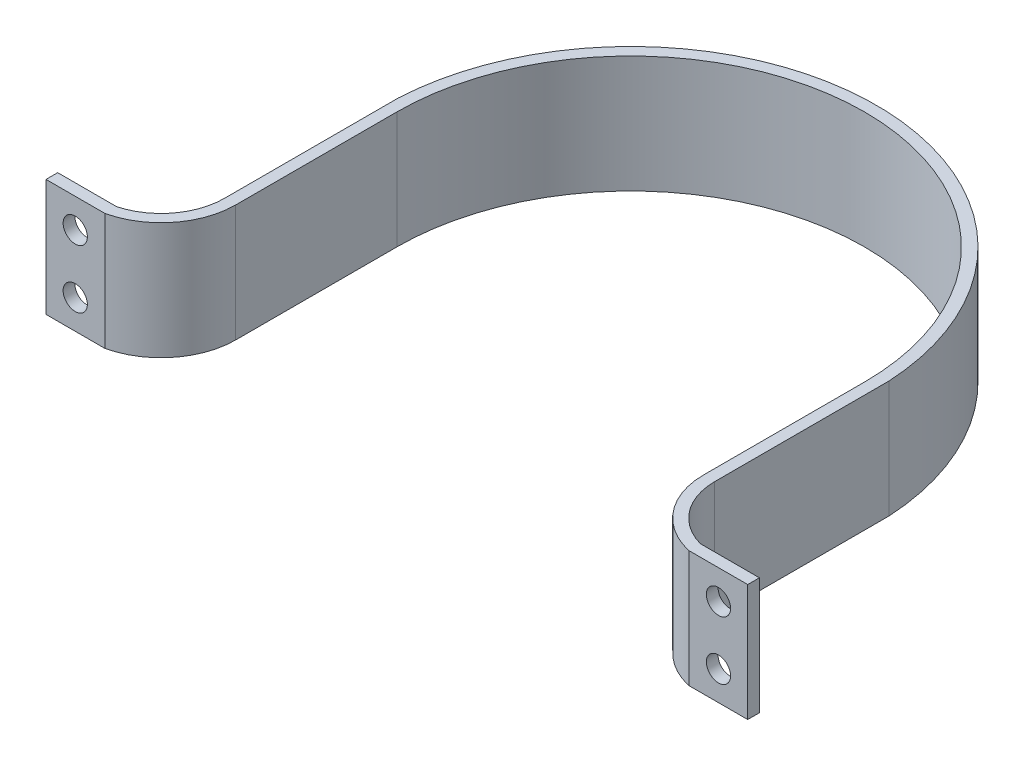
ISO-10303-21;
HEADER;
FILE_DESCRIPTION(('STEP AP214'),'2;1');
FILE_NAME('part.step','',(''),(''),'','','');
FILE_SCHEMA(('AUTOMOTIVE_DESIGN { 1 0 10303 214 1 1 1 1 }'));
ENDSEC;
DATA;
#1=APPLICATION_CONTEXT('core data for automotive mechanical design processes');
#2=APPLICATION_PROTOCOL_DEFINITION('international standard','automotive_design',2000,#1);
#3=PRODUCT_CONTEXT('',#1,'mechanical');
#4=PRODUCT('Part','Part','',(#3));
#5=PRODUCT_RELATED_PRODUCT_CATEGORY('part','',(#4));
#6=PRODUCT_DEFINITION_FORMATION('','',#4);
#7=PRODUCT_DEFINITION_CONTEXT('part definition',#1,'design');
#8=PRODUCT_DEFINITION('design','',#6,#7);
#9=PRODUCT_DEFINITION_SHAPE('','',#8);
#10=(LENGTH_UNIT() NAMED_UNIT(*) SI_UNIT(.MILLI.,.METRE.));
#11=(NAMED_UNIT(*) PLANE_ANGLE_UNIT() SI_UNIT($,.RADIAN.));
#12=(NAMED_UNIT(*) SI_UNIT($,.STERADIAN.) SOLID_ANGLE_UNIT());
#13=UNCERTAINTY_MEASURE_WITH_UNIT(LENGTH_MEASURE(1.E-05),#10,'distance_accuracy_value','');
#14=(GEOMETRIC_REPRESENTATION_CONTEXT(3) GLOBAL_UNCERTAINTY_ASSIGNED_CONTEXT((#13)) GLOBAL_UNIT_ASSIGNED_CONTEXT((#10,
#11,#12)) REPRESENTATION_CONTEXT('',''));
#15=CARTESIAN_POINT('',(0.,0.,0.));
#16=DIRECTION('',(0.,0.,1.));
#17=DIRECTION('',(1.,0.,0.));
#18=AXIS2_PLACEMENT_3D('',#15,#16,#17);
#19=CARTESIAN_POINT('',(24.9634711057996,10.,20.));
#20=DIRECTION('',(0.,0.,-1.));
#21=DIRECTION('',(-1.,0.,0.));
#22=AXIS2_PLACEMENT_3D('',#19,#20,#21);
#23=PLANE('',#22);
#24=DIRECTION('',(1.,0.,0.));
#25=VECTOR('',#24,1.);
#26=CARTESIAN_POINT('',(24.9634711057996,0.,20.));
#27=LINE('',#26,#25);
#28=CARTESIAN_POINT('',(24.9634711057996,0.,20.));
#29=VERTEX_POINT('',#28);
#30=CARTESIAN_POINT('',(30.0034711057996,0.,20.));
#31=VERTEX_POINT('',#30);
#32=EDGE_CURVE('E203',#29,#31,#27,.T.);
#33=ORIENTED_EDGE('',*,*,#32,.T.);
#34=DIRECTION('',(0.,-1.,0.));
#35=VECTOR('',#34,1.);
#36=CARTESIAN_POINT('',(30.0034711057996,10.,20.));
#37=LINE('',#36,#35);
#38=CARTESIAN_POINT('',(30.0034711057996,10.,20.));
#39=VERTEX_POINT('',#38);
#40=EDGE_CURVE('E229',#39,#31,#37,.T.);
#41=ORIENTED_EDGE('',*,*,#40,.F.);
#42=DIRECTION('',(1.,0.,0.));
#43=VECTOR('',#42,1.);
#44=CARTESIAN_POINT('',(24.9634711057996,10.,20.));
#45=LINE('',#44,#43);
#46=CARTESIAN_POINT('',(24.9634711057996,10.,20.));
#47=VERTEX_POINT('',#46);
#48=EDGE_CURVE('E289',#47,#39,#45,.T.);
#49=ORIENTED_EDGE('',*,*,#48,.F.);
#50=DIRECTION('',(0.,-1.,0.));
#51=VECTOR('',#50,1.);
#52=CARTESIAN_POINT('',(24.9634711057996,10.,20.));
#53=LINE('',#52,#51);
#54=EDGE_CURVE('E226',#47,#29,#53,.T.);
#55=ORIENTED_EDGE('',*,*,#54,.T.);
#56=EDGE_LOOP('',(#33,#41,#49,#55));
#57=FACE_BOUND('',#56,.T.);
#58=CARTESIAN_POINT('',(27.5034711057996,7.5,20.));
#59=DIRECTION('',(0.,0.,-1.));
#60=DIRECTION('',(-1.,0.,0.));
#61=AXIS2_PLACEMENT_3D('',#58,#59,#60);
#62=CIRCLE('',#61,1.03605010560066);
#63=CARTESIAN_POINT('',(26.4674210001989,7.5,20.));
#64=VERTEX_POINT('',#63);
#65=EDGE_CURVE('E268',#64,#64,#62,.T.);
#66=ORIENTED_EDGE('',*,*,#65,.T.);
#67=EDGE_LOOP('',(#66));
#68=FACE_BOUND('',#67,.T.);
#69=CARTESIAN_POINT('',(27.5034711057996,2.5,20.));
#70=DIRECTION('',(0.,0.,1.));
#71=DIRECTION('',(1.,0.,0.));
#72=AXIS2_PLACEMENT_3D('',#69,#70,#71);
#73=CIRCLE('',#72,1.03605010560066);
#74=CARTESIAN_POINT('',(28.5395212114003,2.5,20.));
#75=VERTEX_POINT('',#74);
#76=EDGE_CURVE('E409',#75,#75,#73,.T.);
#77=ORIENTED_EDGE('',*,*,#76,.F.);
#78=EDGE_LOOP('',(#77));
#79=FACE_BOUND('',#78,.T.);
#80=ADVANCED_FACE('F33',(#57,#68,#79),#23,.F.);
#81=CARTESIAN_POINT('',(24.9634711057996,10.,19.));
#82=DIRECTION('',(0.,0.,-1.));
#83=DIRECTION('',(-1.,0.,0.));
#84=AXIS2_PLACEMENT_3D('',#81,#82,#83);
#85=PLANE('',#84);
#86=CARTESIAN_POINT('',(27.5034711057996,7.5,19.));
#87=DIRECTION('',(0.,0.,-1.));
#88=DIRECTION('',(-1.,0.,0.));
#89=AXIS2_PLACEMENT_3D('',#86,#87,#88);
#90=CIRCLE('',#89,1.03605010560066);
#91=CARTESIAN_POINT('',(26.4674210001989,7.5,19.));
#92=VERTEX_POINT('',#91);
#93=EDGE_CURVE('E254',#92,#92,#90,.F.);
#94=ORIENTED_EDGE('',*,*,#93,.T.);
#95=EDGE_LOOP('',(#94));
#96=FACE_BOUND('',#95,.T.);
#97=DIRECTION('',(1.,0.,0.));
#98=VECTOR('',#97,1.);
#99=CARTESIAN_POINT('',(24.9634711057996,0.,19.));
#100=LINE('',#99,#98);
#101=CARTESIAN_POINT('',(24.9634711057996,0.,19.));
#102=VERTEX_POINT('',#101);
#103=CARTESIAN_POINT('',(30.0034711057996,0.,19.));
#104=VERTEX_POINT('',#103);
#105=EDGE_CURVE('E197',#102,#104,#100,.T.);
#106=ORIENTED_EDGE('',*,*,#105,.F.);
#107=DIRECTION('',(0.,-1.,0.));
#108=VECTOR('',#107,1.);
#109=CARTESIAN_POINT('',(24.9634711057996,10.,19.));
#110=LINE('',#109,#108);
#111=CARTESIAN_POINT('',(24.9634711057996,10.,19.));
#112=VERTEX_POINT('',#111);
#113=EDGE_CURVE('E234',#112,#102,#110,.T.);
#114=ORIENTED_EDGE('',*,*,#113,.F.);
#115=DIRECTION('',(1.,0.,0.));
#116=VECTOR('',#115,1.);
#117=CARTESIAN_POINT('',(24.9634711057996,10.,19.));
#118=LINE('',#117,#116);
#119=CARTESIAN_POINT('',(30.0034711057996,10.,19.));
#120=VERTEX_POINT('',#119);
#121=EDGE_CURVE('E284',#112,#120,#118,.T.);
#122=ORIENTED_EDGE('',*,*,#121,.T.);
#123=DIRECTION('',(0.,-1.,0.));
#124=VECTOR('',#123,1.);
#125=CARTESIAN_POINT('',(30.0034711057996,10.,19.));
#126=LINE('',#125,#124);
#127=EDGE_CURVE('E232',#120,#104,#126,.T.);
#128=ORIENTED_EDGE('',*,*,#127,.T.);
#129=EDGE_LOOP('',(#106,#114,#122,#128));
#130=FACE_BOUND('',#129,.T.);
#131=CARTESIAN_POINT('',(27.5034711057996,2.5,19.));
#132=DIRECTION('',(0.,0.,-1.));
#133=DIRECTION('',(-1.,0.,0.));
#134=AXIS2_PLACEMENT_3D('',#131,#132,#133);
#135=CIRCLE('',#134,1.03605010560066);
#136=CARTESIAN_POINT('',(26.4674210001989,2.5,19.));
#137=VERTEX_POINT('',#136);
#138=EDGE_CURVE('E37',#137,#137,#135,.T.);
#139=ORIENTED_EDGE('',*,*,#138,.F.);
#140=EDGE_LOOP('',(#139));
#141=FACE_BOUND('',#140,.T.);
#142=ADVANCED_FACE('F320',(#96,#130,#141),#85,.T.);
#143=CARTESIAN_POINT('',(-30.0034711057996,10.,20.));
#144=DIRECTION('',(-1.,0.,0.));
#145=DIRECTION('',(0.,0.,1.));
#146=AXIS2_PLACEMENT_3D('',#143,#144,#145);
#147=PLANE('',#146);
#148=DIRECTION('',(0.,0.,-1.));
#149=VECTOR('',#148,1.);
#150=CARTESIAN_POINT('',(-30.0034711057996,0.,20.));
#151=LINE('',#150,#149);
#152=CARTESIAN_POINT('',(-30.0034711057996,0.,20.));
#153=VERTEX_POINT('',#152);
#154=CARTESIAN_POINT('',(-30.0034711057996,0.,19.));
#155=VERTEX_POINT('',#154);
#156=EDGE_CURVE('E177',#153,#155,#151,.T.);
#157=ORIENTED_EDGE('',*,*,#156,.F.);
#158=DIRECTION('',(0.,-1.,0.));
#159=VECTOR('',#158,1.);
#160=CARTESIAN_POINT('',(-30.0034711057996,10.,20.));
#161=LINE('',#160,#159);
#162=CARTESIAN_POINT('',(-30.0034711057996,10.,20.));
#163=VERTEX_POINT('',#162);
#164=EDGE_CURVE('E11',#163,#153,#161,.T.);
#165=ORIENTED_EDGE('',*,*,#164,.F.);
#166=DIRECTION('',(0.,0.,-1.));
#167=VECTOR('',#166,1.);
#168=CARTESIAN_POINT('',(-30.0034711057996,10.,20.));
#169=LINE('',#168,#167);
#170=CARTESIAN_POINT('',(-30.0034711057996,10.,19.));
#171=VERTEX_POINT('',#170);
#172=EDGE_CURVE('E218',#163,#171,#169,.T.);
#173=ORIENTED_EDGE('',*,*,#172,.T.);
#174=DIRECTION('',(0.,-1.,0.));
#175=VECTOR('',#174,1.);
#176=CARTESIAN_POINT('',(-30.0034711057996,10.,19.));
#177=LINE('',#176,#175);
#178=EDGE_CURVE('E173',#171,#155,#177,.T.);
#179=ORIENTED_EDGE('',*,*,#178,.T.);
#180=EDGE_LOOP('',(#157,#165,#173,#179));
#181=FACE_BOUND('',#180,.T.);
#182=ADVANCED_FACE('F35',(#181),#147,.T.);
#183=CARTESIAN_POINT('',(-24.9634711057996,10.,20.));
#184=DIRECTION('',(0.,0.,1.));
#185=DIRECTION('',(1.,0.,0.));
#186=AXIS2_PLACEMENT_3D('',#183,#184,#185);
#187=PLANE('',#186);
#188=CARTESIAN_POINT('',(-27.5034711057996,2.5,20.));
#189=DIRECTION('',(0.,0.,-1.));
#190=DIRECTION('',(-1.,0.,0.));
#191=AXIS2_PLACEMENT_3D('',#188,#189,#190);
#192=CIRCLE('',#191,1.03605010560066);
#193=CARTESIAN_POINT('',(-28.5395212114003,2.5,20.));
#194=VERTEX_POINT('',#193);
#195=EDGE_CURVE('E255',#194,#194,#192,.T.);
#196=ORIENTED_EDGE('',*,*,#195,.T.);
#197=EDGE_LOOP('',(#196));
#198=FACE_BOUND('',#197,.T.);
#199=CARTESIAN_POINT('',(-27.5034711057996,7.5,20.));
#200=DIRECTION('',(0.,0.,1.));
#201=DIRECTION('',(1.,0.,0.));
#202=AXIS2_PLACEMENT_3D('',#199,#200,#201);
#203=CIRCLE('',#202,1.03605010560066);
#204=CARTESIAN_POINT('',(-26.4674210001989,7.5,20.));
#205=VERTEX_POINT('',#204);
#206=EDGE_CURVE('E251',#205,#205,#203,.T.);
#207=ORIENTED_EDGE('',*,*,#206,.F.);
#208=EDGE_LOOP('',(#207));
#209=FACE_BOUND('',#208,.T.);
#210=DIRECTION('',(-1.,0.,0.));
#211=VECTOR('',#210,1.);
#212=CARTESIAN_POINT('',(-24.9634711057996,0.,20.));
#213=LINE('',#212,#211);
#214=CARTESIAN_POINT('',(-24.9634711057996,0.,20.));
#215=VERTEX_POINT('',#214);
#216=EDGE_CURVE('E216',#215,#153,#213,.T.);
#217=ORIENTED_EDGE('',*,*,#216,.F.);
#218=DIRECTION('',(0.,-1.,0.));
#219=VECTOR('',#218,1.);
#220=CARTESIAN_POINT('',(-24.9634711057996,10.,20.));
#221=LINE('',#220,#219);
#222=CARTESIAN_POINT('',(-24.9634711057996,10.,20.));
#223=VERTEX_POINT('',#222);
#224=EDGE_CURVE('E43',#223,#215,#221,.T.);
#225=ORIENTED_EDGE('',*,*,#224,.F.);
#226=DIRECTION('',(-1.,0.,0.));
#227=VECTOR('',#226,1.);
#228=CARTESIAN_POINT('',(-24.9634711057996,10.,20.));
#229=LINE('',#228,#227);
#230=EDGE_CURVE('E171',#223,#163,#229,.T.);
#231=ORIENTED_EDGE('',*,*,#230,.T.);
#232=ORIENTED_EDGE('',*,*,#164,.T.);
#233=EDGE_LOOP('',(#217,#225,#231,#232));
#234=FACE_BOUND('',#233,.T.);
#235=ADVANCED_FACE('F348',(#198,#209,#234),#187,.T.);
#236=CARTESIAN_POINT('',(-26.389702049754,10.,13.7714275249696));
#237=DIRECTION('',(0.,-1.,0.));
#238=DIRECTION('',(0.,0.,-1.));
#239=AXIS2_PLACEMENT_3D('',#236,#237,#238);
#240=CYLINDRICAL_SURFACE('',#239,6.38977697437083);
#241=CARTESIAN_POINT('',(-26.389702049754,0.,13.7714275249696));
#242=DIRECTION('',(0.,-1.,0.));
#243=DIRECTION('',(0.,0.,-1.));
#244=AXIS2_PLACEMENT_3D('',#241,#242,#243);
#245=CIRCLE('',#244,6.38977697437083);
#246=CARTESIAN_POINT('',(-20.,0.,13.802370982579));
#247=VERTEX_POINT('',#246);
#248=EDGE_CURVE('E157',#247,#215,#245,.T.);
#249=ORIENTED_EDGE('',*,*,#248,.F.);
#250=DIRECTION('',(0.,-1.,0.));
#251=VECTOR('',#250,1.);
#252=CARTESIAN_POINT('',(-20.,10.,13.802370982579));
#253=LINE('',#252,#251);
#254=CARTESIAN_POINT('',(-20.,10.,13.802370982579));
#255=VERTEX_POINT('',#254);
#256=EDGE_CURVE('E151',#255,#247,#253,.T.);
#257=ORIENTED_EDGE('',*,*,#256,.F.);
#258=CARTESIAN_POINT('',(-26.389702049754,10.,13.7714275249696));
#259=DIRECTION('',(0.,-1.,0.));
#260=DIRECTION('',(0.,0.,-1.));
#261=AXIS2_PLACEMENT_3D('',#258,#259,#260);
#262=CIRCLE('',#261,6.38977697437083);
#263=EDGE_CURVE('E155',#255,#223,#262,.T.);
#264=ORIENTED_EDGE('',*,*,#263,.T.);
#265=ORIENTED_EDGE('',*,*,#224,.T.);
#266=EDGE_LOOP('',(#249,#257,#264,#265));
#267=FACE_BOUND('',#266,.T.);
#268=ADVANCED_FACE('F153',(#267),#240,.T.);
#269=CARTESIAN_POINT('',(-20.,10.,13.802370982579));
#270=DIRECTION('',(-1.,0.,0.));
#271=DIRECTION('',(0.,0.,1.));
#272=AXIS2_PLACEMENT_3D('',#269,#270,#271);
#273=PLANE('',#272);
#274=DIRECTION('',(0.,0.,-1.));
#275=VECTOR('',#274,1.);
#276=CARTESIAN_POINT('',(-20.,0.,13.802370982579));
#277=LINE('',#276,#275);
#278=CARTESIAN_POINT('',(-20.,0.,0.));
#279=VERTEX_POINT('',#278);
#280=EDGE_CURVE('E213',#247,#279,#277,.T.);
#281=ORIENTED_EDGE('',*,*,#280,.T.);
#282=DIRECTION('',(0.,-1.,0.));
#283=VECTOR('',#282,1.);
#284=CARTESIAN_POINT('',(-20.,10.,0.));
#285=LINE('',#284,#283);
#286=CARTESIAN_POINT('',(-20.,10.,0.));
#287=VERTEX_POINT('',#286);
#288=EDGE_CURVE('E161',#287,#279,#285,.T.);
#289=ORIENTED_EDGE('',*,*,#288,.F.);
#290=DIRECTION('',(0.,0.,-1.));
#291=VECTOR('',#290,1.);
#292=CARTESIAN_POINT('',(-20.,10.,13.802370982579));
#293=LINE('',#292,#291);
#294=EDGE_CURVE('E164',#255,#287,#293,.T.);
#295=ORIENTED_EDGE('',*,*,#294,.F.);
#296=ORIENTED_EDGE('',*,*,#256,.T.);
#297=EDGE_LOOP('',(#281,#289,#295,#296));
#298=FACE_BOUND('',#297,.T.);
#299=ADVANCED_FACE('F165',(#298),#273,.F.);
#300=CARTESIAN_POINT('',(0.,10.,0.));
#301=DIRECTION('',(0.,-1.,0.));
#302=DIRECTION('',(0.,0.,-1.));
#303=AXIS2_PLACEMENT_3D('',#300,#301,#302);
#304=CYLINDRICAL_SURFACE('',#303,20.);
#305=CARTESIAN_POINT('',(0.,0.,0.));
#306=DIRECTION('',(0.,1.,0.));
#307=DIRECTION('',(0.,0.,1.));
#308=AXIS2_PLACEMENT_3D('',#305,#306,#307);
#309=CIRCLE('',#308,20.);
#310=CARTESIAN_POINT('',(20.,0.,0.));
#311=VERTEX_POINT('',#310);
#312=EDGE_CURVE('E210',#311,#279,#309,.T.);
#313=ORIENTED_EDGE('',*,*,#312,.F.);
#314=DIRECTION('',(0.,-1.,0.));
#315=VECTOR('',#314,1.);
#316=CARTESIAN_POINT('',(20.,10.,0.));
#317=LINE('',#316,#315);
#318=CARTESIAN_POINT('',(20.,10.,0.));
#319=VERTEX_POINT('',#318);
#320=EDGE_CURVE('E222',#319,#311,#317,.T.);
#321=ORIENTED_EDGE('',*,*,#320,.F.);
#322=CARTESIAN_POINT('',(0.,10.,0.));
#323=DIRECTION('',(0.,1.,0.));
#324=DIRECTION('',(0.,0.,1.));
#325=AXIS2_PLACEMENT_3D('',#322,#323,#324);
#326=CIRCLE('',#325,20.);
#327=EDGE_CURVE('E168',#319,#287,#326,.T.);
#328=ORIENTED_EDGE('',*,*,#327,.T.);
#329=ORIENTED_EDGE('',*,*,#288,.T.);
#330=EDGE_LOOP('',(#313,#321,#328,#329));
#331=FACE_BOUND('',#330,.T.);
#332=ADVANCED_FACE('F297',(#331),#304,.F.);
#333=CARTESIAN_POINT('',(20.,10.,13.802370982579));
#334=DIRECTION('',(-1.,0.,0.));
#335=DIRECTION('',(0.,0.,1.));
#336=AXIS2_PLACEMENT_3D('',#333,#334,#335);
#337=PLANE('',#336);
#338=DIRECTION('',(0.,0.,-1.));
#339=VECTOR('',#338,1.);
#340=CARTESIAN_POINT('',(20.,0.,13.802370982579));
#341=LINE('',#340,#339);
#342=CARTESIAN_POINT('',(20.,0.,13.802370982579));
#343=VERTEX_POINT('',#342);
#344=EDGE_CURVE('E207',#343,#311,#341,.T.);
#345=ORIENTED_EDGE('',*,*,#344,.F.);
#346=DIRECTION('',(0.,-1.,0.));
#347=VECTOR('',#346,1.);
#348=CARTESIAN_POINT('',(20.,10.,13.802370982579));
#349=LINE('',#348,#347);
#350=CARTESIAN_POINT('',(20.,10.,13.802370982579));
#351=VERTEX_POINT('',#350);
#352=EDGE_CURVE('E224',#351,#343,#349,.T.);
#353=ORIENTED_EDGE('',*,*,#352,.F.);
#354=DIRECTION('',(0.,0.,-1.));
#355=VECTOR('',#354,1.);
#356=CARTESIAN_POINT('',(20.,10.,13.802370982579));
#357=LINE('',#356,#355);
#358=EDGE_CURVE('E293',#351,#319,#357,.T.);
#359=ORIENTED_EDGE('',*,*,#358,.T.);
#360=ORIENTED_EDGE('',*,*,#320,.T.);
#361=EDGE_LOOP('',(#345,#353,#359,#360));
#362=FACE_BOUND('',#361,.T.);
#363=ADVANCED_FACE('F301',(#362),#337,.T.);
#364=CARTESIAN_POINT('',(26.389702049754,10.,13.7714275249696));
#365=DIRECTION('',(0.,-1.,0.));
#366=DIRECTION('',(0.,0.,-1.));
#367=AXIS2_PLACEMENT_3D('',#364,#365,#366);
#368=CYLINDRICAL_SURFACE('',#367,6.38977697437083);
#369=CARTESIAN_POINT('',(26.389702049754,0.,13.7714275249696));
#370=DIRECTION('',(0.,1.,0.));
#371=DIRECTION('',(0.,0.,1.));
#372=AXIS2_PLACEMENT_3D('',#369,#370,#371);
#373=CIRCLE('',#372,6.38977697437083);
#374=EDGE_CURVE('E205',#343,#29,#373,.T.);
#375=ORIENTED_EDGE('',*,*,#374,.T.);
#376=ORIENTED_EDGE('',*,*,#54,.F.);
#377=CARTESIAN_POINT('',(26.389702049754,10.,13.7714275249696));
#378=DIRECTION('',(0.,1.,0.));
#379=DIRECTION('',(0.,0.,1.));
#380=AXIS2_PLACEMENT_3D('',#377,#378,#379);
#381=CIRCLE('',#380,6.38977697437083);
#382=EDGE_CURVE('E291',#351,#47,#381,.T.);
#383=ORIENTED_EDGE('',*,*,#382,.F.);
#384=ORIENTED_EDGE('',*,*,#352,.T.);
#385=EDGE_LOOP('',(#375,#376,#383,#384));
#386=FACE_BOUND('',#385,.T.);
#387=ADVANCED_FACE('F306',(#386),#368,.T.);
#388=CARTESIAN_POINT('',(30.0034711057996,10.,20.));
#389=DIRECTION('',(-1.,0.,0.));
#390=DIRECTION('',(0.,0.,1.));
#391=AXIS2_PLACEMENT_3D('',#388,#389,#390);
#392=PLANE('',#391);
#393=DIRECTION('',(0.,0.,-1.));
#394=VECTOR('',#393,1.);
#395=CARTESIAN_POINT('',(30.0034711057996,0.,20.));
#396=LINE('',#395,#394);
#397=EDGE_CURVE('E200',#31,#104,#396,.T.);
#398=ORIENTED_EDGE('',*,*,#397,.T.);
#399=ORIENTED_EDGE('',*,*,#127,.F.);
#400=DIRECTION('',(0.,0.,-1.));
#401=VECTOR('',#400,1.);
#402=CARTESIAN_POINT('',(30.0034711057996,10.,20.));
#403=LINE('',#402,#401);
#404=EDGE_CURVE('E287',#39,#120,#403,.T.);
#405=ORIENTED_EDGE('',*,*,#404,.F.);
#406=ORIENTED_EDGE('',*,*,#40,.T.);
#407=EDGE_LOOP('',(#398,#399,#405,#406));
#408=FACE_BOUND('',#407,.T.);
#409=ADVANCED_FACE('F317',(#408),#392,.F.);
#410=CARTESIAN_POINT('',(26.389702049754,10.,13.7714275249696));
#411=DIRECTION('',(0.,-1.,0.));
#412=DIRECTION('',(0.,0.,-1.));
#413=AXIS2_PLACEMENT_3D('',#410,#411,#412);
#414=CYLINDRICAL_SURFACE('',#413,5.41960375231794);
#415=CARTESIAN_POINT('',(26.389702049754,0.,13.7714275249696));
#416=DIRECTION('',(0.,1.,0.));
#417=DIRECTION('',(0.,0.,1.));
#418=AXIS2_PLACEMENT_3D('',#415,#416,#417);
#419=CIRCLE('',#418,5.41960375231794);
#420=CARTESIAN_POINT('',(20.9701866346482,0.,13.802370982579));
#421=VERTEX_POINT('',#420);
#422=EDGE_CURVE('E194',#421,#102,#419,.T.);
#423=ORIENTED_EDGE('',*,*,#422,.F.);
#424=DIRECTION('',(0.,-1.,0.));
#425=VECTOR('',#424,1.);
#426=CARTESIAN_POINT('',(20.9701866346482,10.,13.802370982579));
#427=LINE('',#426,#425);
#428=CARTESIAN_POINT('',(20.9701866346482,10.,13.802370982579));
#429=VERTEX_POINT('',#428);
#430=EDGE_CURVE('E236',#429,#421,#427,.T.);
#431=ORIENTED_EDGE('',*,*,#430,.F.);
#432=CARTESIAN_POINT('',(26.389702049754,10.,13.7714275249696));
#433=DIRECTION('',(0.,1.,0.));
#434=DIRECTION('',(0.,0.,1.));
#435=AXIS2_PLACEMENT_3D('',#432,#433,#434);
#436=CIRCLE('',#435,5.41960375231794);
#437=EDGE_CURVE('E281',#429,#112,#436,.T.);
#438=ORIENTED_EDGE('',*,*,#437,.T.);
#439=ORIENTED_EDGE('',*,*,#113,.T.);
#440=EDGE_LOOP('',(#423,#431,#438,#439));
#441=FACE_BOUND('',#440,.T.);
#442=ADVANCED_FACE('F325',(#441),#414,.F.);
#443=CARTESIAN_POINT('',(20.9701866346482,10.,13.802370982579));
#444=DIRECTION('',(-1.,0.,0.));
#445=DIRECTION('',(0.,0.,1.));
#446=AXIS2_PLACEMENT_3D('',#443,#444,#445);
#447=PLANE('',#446);
#448=DIRECTION('',(0.,0.,-1.));
#449=VECTOR('',#448,1.);
#450=CARTESIAN_POINT('',(20.9701866346482,0.,13.802370982579));
#451=LINE('',#450,#449);
#452=CARTESIAN_POINT('',(20.9701866346482,0.,-1.11860292687935));
#453=VERTEX_POINT('',#452);
#454=EDGE_CURVE('E192',#421,#453,#451,.T.);
#455=ORIENTED_EDGE('',*,*,#454,.T.);
#456=DIRECTION('',(0.,-1.,0.));
#457=VECTOR('',#456,1.);
#458=CARTESIAN_POINT('',(20.9701866346482,10.,-1.11860292687935));
#459=LINE('',#458,#457);
#460=CARTESIAN_POINT('',(20.9701866346482,10.,-1.11860292687935));
#461=VERTEX_POINT('',#460);
#462=EDGE_CURVE('E238',#461,#453,#459,.T.);
#463=ORIENTED_EDGE('',*,*,#462,.F.);
#464=DIRECTION('',(0.,0.,-1.));
#465=VECTOR('',#464,1.);
#466=CARTESIAN_POINT('',(20.9701866346482,10.,13.802370982579));
#467=LINE('',#466,#465);
#468=EDGE_CURVE('E279',#429,#461,#467,.T.);
#469=ORIENTED_EDGE('',*,*,#468,.F.);
#470=ORIENTED_EDGE('',*,*,#430,.T.);
#471=EDGE_LOOP('',(#455,#463,#469,#470));
#472=FACE_BOUND('',#471,.T.);
#473=ADVANCED_FACE('F330',(#472),#447,.F.);
#474=CARTESIAN_POINT('',(0.,10.,0.));
#475=DIRECTION('',(0.,-1.,0.));
#476=DIRECTION('',(0.,0.,-1.));
#477=AXIS2_PLACEMENT_3D('',#474,#475,#476);
#478=CYLINDRICAL_SURFACE('',#477,21.);
#479=CARTESIAN_POINT('',(0.,0.,0.));
#480=DIRECTION('',(0.,1.,0.));
#481=DIRECTION('',(0.,0.,1.));
#482=AXIS2_PLACEMENT_3D('',#479,#480,#481);
#483=CIRCLE('',#482,21.);
#484=CARTESIAN_POINT('',(-20.9701866346482,0.,-1.11860292687936));
#485=VERTEX_POINT('',#484);
#486=EDGE_CURVE('E189',#453,#485,#483,.T.);
#487=ORIENTED_EDGE('',*,*,#486,.T.);
#488=DIRECTION('',(0.,-1.,0.));
#489=VECTOR('',#488,1.);
#490=CARTESIAN_POINT('',(-20.9701866346482,10.,-1.11860292687936));
#491=LINE('',#490,#489);
#492=CARTESIAN_POINT('',(-20.9701866346482,10.,-1.11860292687936));
#493=VERTEX_POINT('',#492);
#494=EDGE_CURVE('E241',#493,#485,#491,.T.);
#495=ORIENTED_EDGE('',*,*,#494,.F.);
#496=CARTESIAN_POINT('',(0.,10.,0.));
#497=DIRECTION('',(0.,1.,0.));
#498=DIRECTION('',(0.,0.,1.));
#499=AXIS2_PLACEMENT_3D('',#496,#497,#498);
#500=CIRCLE('',#499,21.);
#501=EDGE_CURVE('E277',#461,#493,#500,.T.);
#502=ORIENTED_EDGE('',*,*,#501,.F.);
#503=ORIENTED_EDGE('',*,*,#462,.T.);
#504=EDGE_LOOP('',(#487,#495,#502,#503));
#505=FACE_BOUND('',#504,.T.);
#506=ADVANCED_FACE('F335',(#505),#478,.T.);
#507=CARTESIAN_POINT('',(-20.9701866346482,10.,13.802370982579));
#508=DIRECTION('',(-1.,0.,0.));
#509=DIRECTION('',(0.,0.,1.));
#510=AXIS2_PLACEMENT_3D('',#507,#508,#509);
#511=PLANE('',#510);
#512=DIRECTION('',(0.,0.,-1.));
#513=VECTOR('',#512,1.);
#514=CARTESIAN_POINT('',(-20.9701866346482,0.,13.802370982579));
#515=LINE('',#514,#513);
#516=CARTESIAN_POINT('',(-20.9701866346482,0.,13.802370982579));
#517=VERTEX_POINT('',#516);
#518=EDGE_CURVE('E186',#517,#485,#515,.T.);
#519=ORIENTED_EDGE('',*,*,#518,.F.);
#520=DIRECTION('',(0.,-1.,0.));
#521=VECTOR('',#520,1.);
#522=CARTESIAN_POINT('',(-20.9701866346482,10.,13.802370982579));
#523=LINE('',#522,#521);
#524=CARTESIAN_POINT('',(-20.9701866346482,10.,13.802370982579));
#525=VERTEX_POINT('',#524);
#526=EDGE_CURVE('E243',#525,#517,#523,.T.);
#527=ORIENTED_EDGE('',*,*,#526,.F.);
#528=DIRECTION('',(0.,0.,-1.));
#529=VECTOR('',#528,1.);
#530=CARTESIAN_POINT('',(-20.9701866346482,10.,13.802370982579));
#531=LINE('',#530,#529);
#532=EDGE_CURVE('E274',#525,#493,#531,.T.);
#533=ORIENTED_EDGE('',*,*,#532,.T.);
#534=ORIENTED_EDGE('',*,*,#494,.T.);
#535=EDGE_LOOP('',(#519,#527,#533,#534));
#536=FACE_BOUND('',#535,.T.);
#537=ADVANCED_FACE('F339',(#536),#511,.T.);
#538=CARTESIAN_POINT('',(-26.389702049754,10.,13.7714275249696));
#539=DIRECTION('',(0.,-1.,0.));
#540=DIRECTION('',(0.,0.,-1.));
#541=AXIS2_PLACEMENT_3D('',#538,#539,#540);
#542=CYLINDRICAL_SURFACE('',#541,5.41960375231794);
#543=CARTESIAN_POINT('',(-26.389702049754,0.,13.7714275249696));
#544=DIRECTION('',(0.,-1.,0.));
#545=DIRECTION('',(0.,0.,-1.));
#546=AXIS2_PLACEMENT_3D('',#543,#544,#545);
#547=CIRCLE('',#546,5.41960375231794);
#548=CARTESIAN_POINT('',(-24.9634711057996,0.,19.));
#549=VERTEX_POINT('',#548);
#550=EDGE_CURVE('E184',#517,#549,#547,.T.);
#551=ORIENTED_EDGE('',*,*,#550,.T.);
#552=DIRECTION('',(0.,-1.,0.));
#553=VECTOR('',#552,1.);
#554=CARTESIAN_POINT('',(-24.9634711057996,10.,19.));
#555=LINE('',#554,#553);
#556=CARTESIAN_POINT('',(-24.9634711057996,10.,19.));
#557=VERTEX_POINT('',#556);
#558=EDGE_CURVE('E245',#557,#549,#555,.T.);
#559=ORIENTED_EDGE('',*,*,#558,.F.);
#560=CARTESIAN_POINT('',(-26.389702049754,10.,13.7714275249696));
#561=DIRECTION('',(0.,-1.,0.));
#562=DIRECTION('',(0.,0.,-1.));
#563=AXIS2_PLACEMENT_3D('',#560,#561,#562);
#564=CIRCLE('',#563,5.41960375231794);
#565=EDGE_CURVE('E272',#525,#557,#564,.T.);
#566=ORIENTED_EDGE('',*,*,#565,.F.);
#567=ORIENTED_EDGE('',*,*,#526,.T.);
#568=EDGE_LOOP('',(#551,#559,#566,#567));
#569=FACE_BOUND('',#568,.T.);
#570=ADVANCED_FACE('F344',(#569),#542,.F.);
#571=CARTESIAN_POINT('',(-24.9634711057996,10.,19.));
#572=DIRECTION('',(0.,0.,1.));
#573=DIRECTION('',(1.,0.,0.));
#574=AXIS2_PLACEMENT_3D('',#571,#572,#573);
#575=PLANE('',#574);
#576=CARTESIAN_POINT('',(-27.5034711057996,2.5,19.));
#577=DIRECTION('',(0.,0.,1.));
#578=DIRECTION('',(1.,0.,0.));
#579=AXIS2_PLACEMENT_3D('',#576,#577,#578);
#580=CIRCLE('',#579,1.03605010560066);
#581=CARTESIAN_POINT('',(-26.4674210001989,2.5,19.));
#582=VERTEX_POINT('',#581);
#583=EDGE_CURVE('E252',#582,#582,#580,.F.);
#584=ORIENTED_EDGE('',*,*,#583,.F.);
#585=EDGE_LOOP('',(#584));
#586=FACE_BOUND('',#585,.T.);
#587=CARTESIAN_POINT('',(-27.5034711057996,7.5,19.));
#588=DIRECTION('',(0.,0.,1.));
#589=DIRECTION('',(1.,0.,0.));
#590=AXIS2_PLACEMENT_3D('',#587,#588,#589);
#591=CIRCLE('',#590,1.03605010560066);
#592=CARTESIAN_POINT('',(-26.4674210001989,7.5,19.));
#593=VERTEX_POINT('',#592);
#594=EDGE_CURVE('E181',#593,#593,#591,.T.);
#595=ORIENTED_EDGE('',*,*,#594,.T.);
#596=EDGE_LOOP('',(#595));
#597=FACE_BOUND('',#596,.T.);
#598=DIRECTION('',(-1.,0.,0.));
#599=VECTOR('',#598,1.);
#600=CARTESIAN_POINT('',(-24.9634711057996,0.,19.));
#601=LINE('',#600,#599);
#602=EDGE_CURVE('E180',#549,#155,#601,.T.);
#603=ORIENTED_EDGE('',*,*,#602,.T.);
#604=ORIENTED_EDGE('',*,*,#178,.F.);
#605=DIRECTION('',(-1.,0.,0.));
#606=VECTOR('',#605,1.);
#607=CARTESIAN_POINT('',(-24.9634711057996,10.,19.));
#608=LINE('',#607,#606);
#609=EDGE_CURVE('E114',#557,#171,#608,.T.);
#610=ORIENTED_EDGE('',*,*,#609,.F.);
#611=ORIENTED_EDGE('',*,*,#558,.T.);
#612=EDGE_LOOP('',(#603,#604,#610,#611));
#613=FACE_BOUND('',#612,.T.);
#614=ADVANCED_FACE('F347',(#586,#597,#613),#575,.F.);
#615=CARTESIAN_POINT('',(-26.389702049754,10.,13.7714275249696));
#616=DIRECTION('',(0.,-1.,0.));
#617=DIRECTION('',(0.,0.,-1.));
#618=AXIS2_PLACEMENT_3D('',#615,#616,#617);
#619=PLANE('',#618);
#620=ORIENTED_EDGE('',*,*,#172,.F.);
#621=ORIENTED_EDGE('',*,*,#230,.F.);
#622=ORIENTED_EDGE('',*,*,#263,.F.);
#623=ORIENTED_EDGE('',*,*,#294,.T.);
#624=ORIENTED_EDGE('',*,*,#327,.F.);
#625=ORIENTED_EDGE('',*,*,#358,.F.);
#626=ORIENTED_EDGE('',*,*,#382,.T.);
#627=ORIENTED_EDGE('',*,*,#48,.T.);
#628=ORIENTED_EDGE('',*,*,#404,.T.);
#629=ORIENTED_EDGE('',*,*,#121,.F.);
#630=ORIENTED_EDGE('',*,*,#437,.F.);
#631=ORIENTED_EDGE('',*,*,#468,.T.);
#632=ORIENTED_EDGE('',*,*,#501,.T.);
#633=ORIENTED_EDGE('',*,*,#532,.F.);
#634=ORIENTED_EDGE('',*,*,#565,.T.);
#635=ORIENTED_EDGE('',*,*,#609,.T.);
#636=EDGE_LOOP('',(#620,#621,#622,#623,#624,#625,#626,#627,#628,#629,#630,#631,#632,#633,#634,#635));
#637=FACE_BOUND('',#636,.T.);
#638=ADVANCED_FACE('F170',(#637),#619,.F.);
#639=CARTESIAN_POINT('',(-26.389702049754,0.,13.7714275249696));
#640=DIRECTION('',(0.,-1.,0.));
#641=DIRECTION('',(0.,0.,-1.));
#642=AXIS2_PLACEMENT_3D('',#639,#640,#641);
#643=PLANE('',#642);
#644=ORIENTED_EDGE('',*,*,#156,.T.);
#645=ORIENTED_EDGE('',*,*,#602,.F.);
#646=ORIENTED_EDGE('',*,*,#550,.F.);
#647=ORIENTED_EDGE('',*,*,#518,.T.);
#648=ORIENTED_EDGE('',*,*,#486,.F.);
#649=ORIENTED_EDGE('',*,*,#454,.F.);
#650=ORIENTED_EDGE('',*,*,#422,.T.);
#651=ORIENTED_EDGE('',*,*,#105,.T.);
#652=ORIENTED_EDGE('',*,*,#397,.F.);
#653=ORIENTED_EDGE('',*,*,#32,.F.);
#654=ORIENTED_EDGE('',*,*,#374,.F.);
#655=ORIENTED_EDGE('',*,*,#344,.T.);
#656=ORIENTED_EDGE('',*,*,#312,.T.);
#657=ORIENTED_EDGE('',*,*,#280,.F.);
#658=ORIENTED_EDGE('',*,*,#248,.T.);
#659=ORIENTED_EDGE('',*,*,#216,.T.);
#660=EDGE_LOOP('',(#644,#645,#646,#647,#648,#649,#650,#651,#652,#653,#654,#655,#656,#657,#658,#659));
#661=FACE_BOUND('',#660,.T.);
#662=ADVANCED_FACE('F350',(#661),#643,.T.);
#663=CARTESIAN_POINT('',(-27.5034711057996,7.5,-21.));
#664=DIRECTION('',(0.,0.,1.));
#665=DIRECTION('',(1.,0.,0.));
#666=AXIS2_PLACEMENT_3D('',#663,#664,#665);
#667=CYLINDRICAL_SURFACE('',#666,1.03605010560066);
#668=ORIENTED_EDGE('',*,*,#206,.T.);
#669=EDGE_LOOP('',(#668));
#670=FACE_BOUND('',#669,.T.);
#671=ORIENTED_EDGE('',*,*,#594,.F.);
#672=EDGE_LOOP('',(#671));
#673=FACE_BOUND('',#672,.T.);
#674=ADVANCED_FACE('F352',(#670,#673),#667,.F.);
#675=CARTESIAN_POINT('',(-27.5034711057996,2.5,-21.));
#676=DIRECTION('',(0.,0.,1.));
#677=DIRECTION('',(1.,0.,0.));
#678=AXIS2_PLACEMENT_3D('',#675,#676,#677);
#679=CYLINDRICAL_SURFACE('',#678,1.03605010560066);
#680=ORIENTED_EDGE('',*,*,#195,.F.);
#681=EDGE_LOOP('',(#680));
#682=FACE_BOUND('',#681,.T.);
#683=ORIENTED_EDGE('',*,*,#583,.T.);
#684=EDGE_LOOP('',(#683));
#685=FACE_BOUND('',#684,.T.);
#686=ADVANCED_FACE('F358',(#682,#685),#679,.F.);
#687=CARTESIAN_POINT('',(27.5034711057996,7.5,-21.));
#688=DIRECTION('',(0.,0.,1.));
#689=DIRECTION('',(1.,0.,0.));
#690=AXIS2_PLACEMENT_3D('',#687,#688,#689);
#691=CYLINDRICAL_SURFACE('',#690,1.03605010560066);
#692=ORIENTED_EDGE('',*,*,#93,.F.);
#693=EDGE_LOOP('',(#692));
#694=FACE_BOUND('',#693,.T.);
#695=ORIENTED_EDGE('',*,*,#65,.F.);
#696=EDGE_LOOP('',(#695));
#697=FACE_BOUND('',#696,.T.);
#698=ADVANCED_FACE('F392',(#694,#697),#691,.F.);
#699=CARTESIAN_POINT('',(27.5034711057996,2.5,-21.));
#700=DIRECTION('',(0.,0.,1.));
#701=DIRECTION('',(1.,0.,0.));
#702=AXIS2_PLACEMENT_3D('',#699,#700,#701);
#703=CYLINDRICAL_SURFACE('',#702,1.03605010560066);
#704=ORIENTED_EDGE('',*,*,#138,.T.);
#705=EDGE_LOOP('',(#704));
#706=FACE_BOUND('',#705,.T.);
#707=ORIENTED_EDGE('',*,*,#76,.T.);
#708=EDGE_LOOP('',(#707));
#709=FACE_BOUND('',#708,.T.);
#710=ADVANCED_FACE('F398',(#706,#709),#703,.F.);
#711=CLOSED_SHELL('',(#80,#142,#182,#235,#268,#299,#332,#363,#387,#409,#442,#473,#506,#537,#570,
#614,#638,#662,#674,#686,#698,#710));
#712=MANIFOLD_SOLID_BREP('B2',#711);
#713=ADVANCED_BREP_SHAPE_REPRESENTATION('',(#18,#712),#14);
#714=SHAPE_DEFINITION_REPRESENTATION(#9,#713);
ENDSEC;
END-ISO-10303-21;
